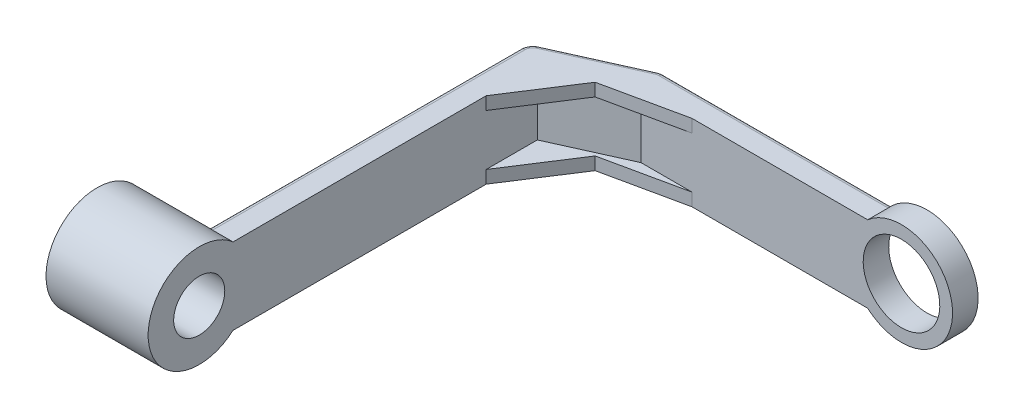
ISO-10303-21;
HEADER;
FILE_DESCRIPTION(('STEP AP214'),'2;1');
FILE_NAME('part.step','',(''),(''),'','','');
FILE_SCHEMA(('AUTOMOTIVE_DESIGN { 1 0 10303 214 1 1 1 1 }'));
ENDSEC;
DATA;
#1=APPLICATION_CONTEXT('core data for automotive mechanical design processes');
#2=APPLICATION_PROTOCOL_DEFINITION('international standard','automotive_design',2000,#1);
#3=PRODUCT_CONTEXT('',#1,'mechanical');
#4=PRODUCT('Part','Part','',(#3));
#5=PRODUCT_RELATED_PRODUCT_CATEGORY('part','',(#4));
#6=PRODUCT_DEFINITION_FORMATION('','',#4);
#7=PRODUCT_DEFINITION_CONTEXT('part definition',#1,'design');
#8=PRODUCT_DEFINITION('design','',#6,#7);
#9=PRODUCT_DEFINITION_SHAPE('','',#8);
#10=(LENGTH_UNIT() NAMED_UNIT(*) SI_UNIT(.MILLI.,.METRE.));
#11=(NAMED_UNIT(*) PLANE_ANGLE_UNIT() SI_UNIT($,.RADIAN.));
#12=(NAMED_UNIT(*) SI_UNIT($,.STERADIAN.) SOLID_ANGLE_UNIT());
#13=UNCERTAINTY_MEASURE_WITH_UNIT(LENGTH_MEASURE(1.E-05),#10,'distance_accuracy_value','');
#14=(GEOMETRIC_REPRESENTATION_CONTEXT(3) GLOBAL_UNCERTAINTY_ASSIGNED_CONTEXT((#13)) GLOBAL_UNIT_ASSIGNED_CONTEXT((#10,
#11,#12)) REPRESENTATION_CONTEXT('',''));
#15=CARTESIAN_POINT('',(0.,0.,0.));
#16=DIRECTION('',(0.,0.,1.));
#17=DIRECTION('',(1.,0.,0.));
#18=AXIS2_PLACEMENT_3D('',#15,#16,#17);
#19=CARTESIAN_POINT('',(28.0050724767935,-15.,-145.));
#20=DIRECTION('',(0.410514823388502,0.,0.911853924583487));
#21=DIRECTION('',(0.911853924583487,0.,-0.410514823388502));
#22=AXIS2_PLACEMENT_3D('',#19,#20,#21);
#23=PLANE('',#22);
#24=DIRECTION('',(0.911853924583487,0.,-0.410514823388502));
#25=VECTOR('',#24,1.);
#26=CARTESIAN_POINT('',(9.76799398512372,10.,-136.78970353223));
#27=LINE('',#26,#25);
#28=CARTESIAN_POINT('',(0.,10.,-132.392172066327));
#29=VERTEX_POINT('',#28);
#30=CARTESIAN_POINT('',(28.0050724767935,10.,-145.));
#31=VERTEX_POINT('',#30);
#32=EDGE_CURVE('E211',#29,#31,#27,.T.);
#33=ORIENTED_EDGE('',*,*,#32,.F.);
#34=DIRECTION('',(0.,1.,0.));
#35=VECTOR('',#34,1.);
#36=CARTESIAN_POINT('',(0.,-15.,-132.392172066327));
#37=LINE('',#36,#35);
#38=CARTESIAN_POINT('',(0.,-10.,-132.392172066327));
#39=VERTEX_POINT('',#38);
#40=EDGE_CURVE('E203',#39,#29,#37,.T.);
#41=ORIENTED_EDGE('',*,*,#40,.F.);
#42=DIRECTION('',(0.911853924583487,0.,-0.410514823388502));
#43=VECTOR('',#42,1.);
#44=CARTESIAN_POINT('',(9.76799398512372,-10.,-136.78970353223));
#45=LINE('',#44,#43);
#46=CARTESIAN_POINT('',(28.0050724767935,-10.,-145.));
#47=VERTEX_POINT('',#46);
#48=EDGE_CURVE('E187',#39,#47,#45,.T.);
#49=ORIENTED_EDGE('',*,*,#48,.T.);
#50=DIRECTION('',(0.,-1.,0.));
#51=VECTOR('',#50,1.);
#52=CARTESIAN_POINT('',(28.0050724767935,-15.,-145.));
#53=LINE('',#52,#51);
#54=EDGE_CURVE('E229',#31,#47,#53,.T.);
#55=ORIENTED_EDGE('',*,*,#54,.F.);
#56=EDGE_LOOP('',(#33,#41,#49,#55));
#57=FACE_BOUND('',#56,.T.);
#58=ADVANCED_FACE('F38',(#57),#23,.T.);
#59=CARTESIAN_POINT('',(0.,-15.,-15.));
#60=DIRECTION('',(1.,0.,0.));
#61=DIRECTION('',(0.,0.,-1.));
#62=AXIS2_PLACEMENT_3D('',#59,#60,#61);
#63=PLANE('',#62);
#64=CARTESIAN_POINT('',(0.,0.,0.));
#65=DIRECTION('',(1.,0.,0.));
#66=DIRECTION('',(0.,0.,-1.));
#67=AXIS2_PLACEMENT_3D('',#64,#65,#66);
#68=CIRCLE('',#67,10.);
#69=CARTESIAN_POINT('',(0.,0.,-10.));
#70=VERTEX_POINT('',#69);
#71=EDGE_CURVE('E452',#70,#70,#68,.T.);
#72=ORIENTED_EDGE('',*,*,#71,.F.);
#73=EDGE_LOOP('',(#72));
#74=FACE_BOUND('',#73,.T.);
#75=DIRECTION('',(0.,0.,-1.));
#76=VECTOR('',#75,1.);
#77=CARTESIAN_POINT('',(0.,10.,-112.392172066327));
#78=LINE('',#77,#76);
#79=CARTESIAN_POINT('',(0.,10.,-112.392172066327));
#80=VERTEX_POINT('',#79);
#81=EDGE_CURVE('E469',#80,#29,#78,.T.);
#82=ORIENTED_EDGE('',*,*,#81,.F.);
#83=DIRECTION('',(0.,1.,0.));
#84=VECTOR('',#83,1.);
#85=CARTESIAN_POINT('',(0.,10.,-112.392172066327));
#86=LINE('',#85,#84);
#87=CARTESIAN_POINT('',(0.,15.,-112.392172066327));
#88=VERTEX_POINT('',#87);
#89=EDGE_CURVE('E467',#80,#88,#86,.T.);
#90=ORIENTED_EDGE('',*,*,#89,.T.);
#91=DIRECTION('',(0.,0.,-1.));
#92=VECTOR('',#91,1.);
#93=CARTESIAN_POINT('',(0.,15.,-15.));
#94=LINE('',#93,#92);
#95=CARTESIAN_POINT('',(0.,15.,-13.228756555323));
#96=VERTEX_POINT('',#95);
#97=EDGE_CURVE('E218',#96,#88,#94,.T.);
#98=ORIENTED_EDGE('',*,*,#97,.F.);
#99=CARTESIAN_POINT('',(0.,0.,0.));
#100=DIRECTION('',(1.,0.,0.));
#101=DIRECTION('',(0.,0.,-1.));
#102=AXIS2_PLACEMENT_3D('',#99,#100,#101);
#103=CIRCLE('',#102,20.);
#104=CARTESIAN_POINT('',(0.,-15.,-13.228756555323));
#105=VERTEX_POINT('',#104);
#106=EDGE_CURVE('E437',#96,#105,#103,.T.);
#107=ORIENTED_EDGE('',*,*,#106,.T.);
#108=DIRECTION('',(0.,0.,-1.));
#109=VECTOR('',#108,1.);
#110=CARTESIAN_POINT('',(0.,-15.,-15.));
#111=LINE('',#110,#109);
#112=CARTESIAN_POINT('',(0.,-15.,-112.392172066327));
#113=VERTEX_POINT('',#112);
#114=EDGE_CURVE('E213',#105,#113,#111,.T.);
#115=ORIENTED_EDGE('',*,*,#114,.T.);
#116=DIRECTION('',(0.,-1.,0.));
#117=VECTOR('',#116,1.);
#118=CARTESIAN_POINT('',(0.,-10.,-112.392172066327));
#119=LINE('',#118,#117);
#120=CARTESIAN_POINT('',(0.,-10.,-112.392172066327));
#121=VERTEX_POINT('',#120);
#122=EDGE_CURVE('E207',#121,#113,#119,.T.);
#123=ORIENTED_EDGE('',*,*,#122,.F.);
#124=DIRECTION('',(0.,0.,-1.));
#125=VECTOR('',#124,1.);
#126=CARTESIAN_POINT('',(0.,-10.,-112.392172066327));
#127=LINE('',#126,#125);
#128=EDGE_CURVE('E191',#121,#39,#127,.T.);
#129=ORIENTED_EDGE('',*,*,#128,.T.);
#130=ORIENTED_EDGE('',*,*,#40,.T.);
#131=EDGE_LOOP('',(#82,#90,#98,#107,#115,#123,#129,#130));
#132=FACE_BOUND('',#131,.T.);
#133=ADVANCED_FACE('F202',(#74,#132),#63,.T.);
#134=CARTESIAN_POINT('',(48.0050724767935,10.,-145.));
#135=DIRECTION('',(-0.209935794252092,0.,-0.977715174420313));
#136=DIRECTION('',(-0.977715174420313,0.,0.209935794252092));
#137=AXIS2_PLACEMENT_3D('',#134,#135,#136);
#138=PLANE('',#137);
#139=DIRECTION('',(0.,1.,0.));
#140=VECTOR('',#139,1.);
#141=CARTESIAN_POINT('',(16.7400359856065,10.,-138.286746038293));
#142=LINE('',#141,#140);
#143=CARTESIAN_POINT('',(16.7400359856065,10.,-138.286746038293));
#144=VERTEX_POINT('',#143);
#145=CARTESIAN_POINT('',(16.7400359856064,15.,-138.286746038293));
#146=VERTEX_POINT('',#145);
#147=EDGE_CURVE('E468',#144,#146,#142,.T.);
#148=ORIENTED_EDGE('',*,*,#147,.F.);
#149=DIRECTION('',(-0.977715174420313,0.,0.209935794252092));
#150=VECTOR('',#149,1.);
#151=CARTESIAN_POINT('',(48.0050724767935,10.,-145.));
#152=LINE('',#151,#150);
#153=CARTESIAN_POINT('',(48.0050724767935,10.,-145.));
#154=VERTEX_POINT('',#153);
#155=EDGE_CURVE('E483',#154,#144,#152,.T.);
#156=ORIENTED_EDGE('',*,*,#155,.F.);
#157=DIRECTION('',(0.,1.,0.));
#158=VECTOR('',#157,1.);
#159=CARTESIAN_POINT('',(48.0050724767935,10.,-145.));
#160=LINE('',#159,#158);
#161=CARTESIAN_POINT('',(48.0050724767935,15.,-145.));
#162=VERTEX_POINT('',#161);
#163=EDGE_CURVE('E489',#154,#162,#160,.T.);
#164=ORIENTED_EDGE('',*,*,#163,.T.);
#165=DIRECTION('',(-0.977715174420313,0.,0.209935794252092));
#166=VECTOR('',#165,1.);
#167=CARTESIAN_POINT('',(48.0050724767935,15.,-145.));
#168=LINE('',#167,#166);
#169=EDGE_CURVE('E481',#162,#146,#168,.T.);
#170=ORIENTED_EDGE('',*,*,#169,.T.);
#171=EDGE_LOOP('',(#148,#156,#164,#170));
#172=FACE_BOUND('',#171,.T.);
#173=ADVANCED_FACE('F374',(#172),#138,.F.);
#174=CARTESIAN_POINT('',(130.,0.,-145.));
#175=DIRECTION('',(0.,0.,1.));
#176=DIRECTION('',(0.,1.,0.));
#177=AXIS2_PLACEMENT_3D('',#174,#175,#176);
#178=PLANE('',#177);
#179=CARTESIAN_POINT('',(130.,0.,-145.));
#180=DIRECTION('',(0.,0.,1.));
#181=DIRECTION('',(0.,1.,0.));
#182=AXIS2_PLACEMENT_3D('',#179,#180,#181);
#183=CIRCLE('',#182,15.);
#184=CARTESIAN_POINT('',(130.,15.,-145.));
#185=VERTEX_POINT('',#184);
#186=EDGE_CURVE('E216',#185,#185,#183,.T.);
#187=ORIENTED_EDGE('',*,*,#186,.F.);
#188=EDGE_LOOP('',(#187));
#189=FACE_BOUND('',#188,.T.);
#190=DIRECTION('',(-1.,0.,0.));
#191=VECTOR('',#190,1.);
#192=CARTESIAN_POINT('',(28.0050724767935,15.,-145.));
#193=LINE('',#192,#191);
#194=CARTESIAN_POINT('',(116.771243444677,15.,-145.));
#195=VERTEX_POINT('',#194);
#196=EDGE_CURVE('E227',#195,#162,#193,.T.);
#197=ORIENTED_EDGE('',*,*,#196,.T.);
#198=ORIENTED_EDGE('',*,*,#163,.F.);
#199=DIRECTION('',(1.,0.,0.));
#200=VECTOR('',#199,1.);
#201=CARTESIAN_POINT('',(28.0050724767935,10.,-145.));
#202=LINE('',#201,#200);
#203=EDGE_CURVE('E486',#31,#154,#202,.T.);
#204=ORIENTED_EDGE('',*,*,#203,.F.);
#205=ORIENTED_EDGE('',*,*,#54,.T.);
#206=DIRECTION('',(1.,0.,0.));
#207=VECTOR('',#206,1.);
#208=CARTESIAN_POINT('',(28.0050724767935,-10.,-145.));
#209=LINE('',#208,#207);
#210=CARTESIAN_POINT('',(48.0050724767935,-10.,-145.));
#211=VERTEX_POINT('',#210);
#212=EDGE_CURVE('E194',#47,#211,#209,.T.);
#213=ORIENTED_EDGE('',*,*,#212,.T.);
#214=DIRECTION('',(0.,-1.,0.));
#215=VECTOR('',#214,1.);
#216=CARTESIAN_POINT('',(48.0050724767935,-10.,-145.));
#217=LINE('',#216,#215);
#218=CARTESIAN_POINT('',(48.0050724767935,-15.,-145.));
#219=VERTEX_POINT('',#218);
#220=EDGE_CURVE('E428',#211,#219,#217,.T.);
#221=ORIENTED_EDGE('',*,*,#220,.T.);
#222=DIRECTION('',(1.,0.,0.));
#223=VECTOR('',#222,1.);
#224=CARTESIAN_POINT('',(28.0050724767935,-15.,-145.));
#225=LINE('',#224,#223);
#226=CARTESIAN_POINT('',(116.771243444677,-15.,-145.));
#227=VERTEX_POINT('',#226);
#228=EDGE_CURVE('E231',#219,#227,#225,.T.);
#229=ORIENTED_EDGE('',*,*,#228,.T.);
#230=CARTESIAN_POINT('',(130.,0.,-145.));
#231=DIRECTION('',(0.,0.,1.));
#232=DIRECTION('',(0.,1.,0.));
#233=AXIS2_PLACEMENT_3D('',#230,#231,#232);
#234=CIRCLE('',#233,20.);
#235=EDGE_CURVE('E224',#227,#195,#234,.T.);
#236=ORIENTED_EDGE('',*,*,#235,.T.);
#237=EDGE_LOOP('',(#197,#198,#204,#205,#213,#221,#229,#236));
#238=FACE_BOUND('',#237,.T.);
#239=ADVANCED_FACE('F390',(#189,#238),#178,.T.);
#240=CARTESIAN_POINT('',(28.0050724767935,15.,-145.));
#241=DIRECTION('',(0.,-1.,0.));
#242=DIRECTION('',(1.,0.,0.));
#243=AXIS2_PLACEMENT_3D('',#240,#241,#242);
#244=PLANE('',#243);
#245=CARTESIAN_POINT('',(-5.00000000000003,15.,-135.624516418416));
#246=DIRECTION('',(0.,-1.,0.));
#247=DIRECTION('',(1.,0.,0.));
#248=AXIS2_PLACEMENT_3D('',#245,#246,#247);
#249=CIRCLE('',#248,3.);
#250=CARTESIAN_POINT('',(-6.23154447016555,15.,-138.360078192166));
#251=VERTEX_POINT('',#250);
#252=CARTESIAN_POINT('',(-8.00000000000004,15.,-135.624516418416));
#253=VERTEX_POINT('',#252);
#254=EDGE_CURVE('E258',#251,#253,#249,.F.);
#255=ORIENTED_EDGE('',*,*,#254,.T.);
#256=DIRECTION('',(0.,0.,1.));
#257=VECTOR('',#256,1.);
#258=CARTESIAN_POINT('',(-8.00000000000001,15.,-13.228756555323));
#259=LINE('',#258,#257);
#260=CARTESIAN_POINT('',(-8.00000000000001,15.,-13.228756555323));
#261=VERTEX_POINT('',#260);
#262=EDGE_CURVE('E260',#253,#261,#259,.T.);
#263=ORIENTED_EDGE('',*,*,#262,.T.);
#264=DIRECTION('',(-1.,0.,0.));
#265=VECTOR('',#264,1.);
#266=CARTESIAN_POINT('',(0.,15.,-13.228756555323));
#267=LINE('',#266,#265);
#268=EDGE_CURVE('E442',#96,#261,#267,.T.);
#269=ORIENTED_EDGE('',*,*,#268,.F.);
#270=ORIENTED_EDGE('',*,*,#97,.T.);
#271=DIRECTION('',(-0.542902006172154,0.,0.839796053631029));
#272=VECTOR('',#271,1.);
#273=CARTESIAN_POINT('',(18.2370784916697,15.,-140.602468534097));
#274=LINE('',#273,#272);
#275=EDGE_CURVE('E462',#146,#88,#274,.T.);
#276=ORIENTED_EDGE('',*,*,#275,.F.);
#277=ORIENTED_EDGE('',*,*,#169,.F.);
#278=ORIENTED_EDGE('',*,*,#196,.F.);
#279=DIRECTION('',(0.,0.,-1.));
#280=VECTOR('',#279,1.);
#281=CARTESIAN_POINT('',(116.771243444677,15.,-145.));
#282=LINE('',#281,#280);
#283=CARTESIAN_POINT('',(116.771243444677,15.,-153.));
#284=VERTEX_POINT('',#283);
#285=EDGE_CURVE('E237',#195,#284,#282,.T.);
#286=ORIENTED_EDGE('',*,*,#285,.T.);
#287=DIRECTION('',(-1.,0.,0.));
#288=VECTOR('',#287,1.);
#289=CARTESIAN_POINT('',(28.0050724767935,15.,-153.));
#290=LINE('',#289,#288);
#291=CARTESIAN_POINT('',(26.9314684265312,15.,-153.));
#292=VERTEX_POINT('',#291);
#293=EDGE_CURVE('E252',#284,#292,#290,.T.);
#294=ORIENTED_EDGE('',*,*,#293,.T.);
#295=CARTESIAN_POINT('',(26.9314684265312,15.,-150.));
#296=DIRECTION('',(0.,-1.,0.));
#297=DIRECTION('',(1.,0.,0.));
#298=AXIS2_PLACEMENT_3D('',#295,#296,#297);
#299=CIRCLE('',#298,3.);
#300=CARTESIAN_POINT('',(25.6999239563657,15.,-152.735561773751));
#301=VERTEX_POINT('',#300);
#302=EDGE_CURVE('E254',#292,#301,#299,.F.);
#303=ORIENTED_EDGE('',*,*,#302,.T.);
#304=DIRECTION('',(-0.911853924583486,0.,0.410514823388503));
#305=VECTOR('',#304,1.);
#306=CARTESIAN_POINT('',(-6.23154447016555,15.,-138.360078192166));
#307=LINE('',#306,#305);
#308=EDGE_CURVE('E256',#301,#251,#307,.T.);
#309=ORIENTED_EDGE('',*,*,#308,.T.);
#310=EDGE_LOOP('',(#255,#263,#269,#270,#276,#277,#278,#286,#294,#303,#309));
#311=FACE_BOUND('',#310,.T.);
#312=ADVANCED_FACE('F353',(#311),#244,.F.);
#313=CARTESIAN_POINT('',(28.0050724767935,-15.,-145.));
#314=DIRECTION('',(0.,1.,0.));
#315=DIRECTION('',(-1.,0.,0.));
#316=AXIS2_PLACEMENT_3D('',#313,#314,#315);
#317=PLANE('',#316);
#318=CARTESIAN_POINT('',(26.9314684265312,-15.,-150.));
#319=DIRECTION('',(0.,1.,0.));
#320=DIRECTION('',(-1.,0.,0.));
#321=AXIS2_PLACEMENT_3D('',#318,#319,#320);
#322=CIRCLE('',#321,3.);
#323=CARTESIAN_POINT('',(25.6999239563657,-15.,-152.735561773751));
#324=VERTEX_POINT('',#323);
#325=CARTESIAN_POINT('',(26.9314684265312,-15.,-153.));
#326=VERTEX_POINT('',#325);
#327=EDGE_CURVE('E285',#324,#326,#322,.F.);
#328=ORIENTED_EDGE('',*,*,#327,.T.);
#329=DIRECTION('',(1.,0.,0.));
#330=VECTOR('',#329,1.);
#331=CARTESIAN_POINT('',(28.0050724767935,-15.,-153.));
#332=LINE('',#331,#330);
#333=CARTESIAN_POINT('',(116.771243444677,-15.,-153.));
#334=VERTEX_POINT('',#333);
#335=EDGE_CURVE('E287',#326,#334,#332,.T.);
#336=ORIENTED_EDGE('',*,*,#335,.T.);
#337=DIRECTION('',(0.,0.,-1.));
#338=VECTOR('',#337,1.);
#339=CARTESIAN_POINT('',(116.771243444677,-15.,-145.));
#340=LINE('',#339,#338);
#341=EDGE_CURVE('E233',#227,#334,#340,.T.);
#342=ORIENTED_EDGE('',*,*,#341,.F.);
#343=ORIENTED_EDGE('',*,*,#228,.F.);
#344=DIRECTION('',(-0.977715174420313,0.,0.209935794252092));
#345=VECTOR('',#344,1.);
#346=CARTESIAN_POINT('',(48.0050724767935,-15.,-145.));
#347=LINE('',#346,#345);
#348=CARTESIAN_POINT('',(16.7400359856064,-15.,-138.286746038293));
#349=VERTEX_POINT('',#348);
#350=EDGE_CURVE('E198',#219,#349,#347,.T.);
#351=ORIENTED_EDGE('',*,*,#350,.T.);
#352=DIRECTION('',(-0.542902006172154,0.,0.839796053631029));
#353=VECTOR('',#352,1.);
#354=CARTESIAN_POINT('',(18.2370784916697,-15.,-140.602468534097));
#355=LINE('',#354,#353);
#356=EDGE_CURVE('E209',#349,#113,#355,.T.);
#357=ORIENTED_EDGE('',*,*,#356,.T.);
#358=ORIENTED_EDGE('',*,*,#114,.F.);
#359=DIRECTION('',(-1.,0.,0.));
#360=VECTOR('',#359,1.);
#361=CARTESIAN_POINT('',(0.,-15.,-13.228756555323));
#362=LINE('',#361,#360);
#363=CARTESIAN_POINT('',(-8.00000000000001,-15.,-13.228756555323));
#364=VERTEX_POINT('',#363);
#365=EDGE_CURVE('E439',#105,#364,#362,.T.);
#366=ORIENTED_EDGE('',*,*,#365,.T.);
#367=DIRECTION('',(0.,0.,1.));
#368=VECTOR('',#367,1.);
#369=CARTESIAN_POINT('',(-8.00000000000004,-15.,-135.624516418416));
#370=LINE('',#369,#368);
#371=CARTESIAN_POINT('',(-8.00000000000004,-15.,-135.624516418416));
#372=VERTEX_POINT('',#371);
#373=EDGE_CURVE('E279',#364,#372,#370,.F.);
#374=ORIENTED_EDGE('',*,*,#373,.T.);
#375=CARTESIAN_POINT('',(-5.00000000000003,-15.,-135.624516418416));
#376=DIRECTION('',(0.,1.,0.));
#377=DIRECTION('',(-1.,0.,0.));
#378=AXIS2_PLACEMENT_3D('',#375,#376,#377);
#379=CIRCLE('',#378,3.);
#380=CARTESIAN_POINT('',(-6.23154447016555,-15.,-138.360078192166));
#381=VERTEX_POINT('',#380);
#382=EDGE_CURVE('E281',#372,#381,#379,.F.);
#383=ORIENTED_EDGE('',*,*,#382,.T.);
#384=DIRECTION('',(-0.911853924583486,0.,0.410514823388503));
#385=VECTOR('',#384,1.);
#386=CARTESIAN_POINT('',(25.6999239563657,-15.,-152.73556177375));
#387=LINE('',#386,#385);
#388=EDGE_CURVE('E283',#381,#324,#387,.F.);
#389=ORIENTED_EDGE('',*,*,#388,.T.);
#390=EDGE_LOOP('',(#328,#336,#342,#343,#351,#357,#358,#366,#374,#383,#389));
#391=FACE_BOUND('',#390,.T.);
#392=ADVANCED_FACE('F395',(#391),#317,.F.);
#393=CARTESIAN_POINT('',(130.,0.,-155.));
#394=DIRECTION('',(0.,0.,1.));
#395=DIRECTION('',(0.,1.,0.));
#396=AXIS2_PLACEMENT_3D('',#393,#394,#395);
#397=PLANE('',#396);
#398=CARTESIAN_POINT('',(130.,0.,-155.));
#399=DIRECTION('',(0.,0.,1.));
#400=DIRECTION('',(0.,1.,0.));
#401=AXIS2_PLACEMENT_3D('',#398,#399,#400);
#402=CIRCLE('',#401,20.);
#403=CARTESIAN_POINT('',(114.801315846429,-13.,-155.));
#404=VERTEX_POINT('',#403);
#405=CARTESIAN_POINT('',(114.801315846429,13.,-155.));
#406=VERTEX_POINT('',#405);
#407=EDGE_CURVE('E56',#404,#406,#402,.T.);
#408=ORIENTED_EDGE('',*,*,#407,.F.);
#409=DIRECTION('',(1.,0.,0.));
#410=VECTOR('',#409,1.);
#411=CARTESIAN_POINT('',(130.,-13.,-155.));
#412=LINE('',#411,#410);
#413=CARTESIAN_POINT('',(26.9314684265312,-13.,-155.));
#414=VERTEX_POINT('',#413);
#415=EDGE_CURVE('E292',#404,#414,#412,.F.);
#416=ORIENTED_EDGE('',*,*,#415,.T.);
#417=DIRECTION('',(0.,1.,0.));
#418=VECTOR('',#417,1.);
#419=CARTESIAN_POINT('',(26.9314684265312,15.,-155.));
#420=LINE('',#419,#418);
#421=CARTESIAN_POINT('',(26.9314684265312,13.,-155.));
#422=VERTEX_POINT('',#421);
#423=EDGE_CURVE('E240',#414,#422,#420,.T.);
#424=ORIENTED_EDGE('',*,*,#423,.T.);
#425=DIRECTION('',(-1.,0.,0.));
#426=VECTOR('',#425,1.);
#427=CARTESIAN_POINT('',(130.,13.,-155.));
#428=LINE('',#427,#426);
#429=EDGE_CURVE('E290',#422,#406,#428,.F.);
#430=ORIENTED_EDGE('',*,*,#429,.T.);
#431=EDGE_LOOP('',(#408,#416,#424,#430));
#432=FACE_BOUND('',#431,.T.);
#433=CARTESIAN_POINT('',(130.,0.,-155.));
#434=DIRECTION('',(0.,0.,1.));
#435=DIRECTION('',(0.,1.,0.));
#436=AXIS2_PLACEMENT_3D('',#433,#434,#435);
#437=CIRCLE('',#436,15.);
#438=CARTESIAN_POINT('',(130.,15.,-155.));
#439=VERTEX_POINT('',#438);
#440=EDGE_CURVE('E212',#439,#439,#437,.T.);
#441=ORIENTED_EDGE('',*,*,#440,.T.);
#442=EDGE_LOOP('',(#441));
#443=FACE_BOUND('',#442,.T.);
#444=ADVANCED_FACE('F352',(#432,#443),#397,.F.);
#445=CARTESIAN_POINT('',(130.,0.,-145.));
#446=DIRECTION('',(0.,0.,-1.));
#447=DIRECTION('',(0.,-1.,0.));
#448=AXIS2_PLACEMENT_3D('',#445,#446,#447);
#449=CYLINDRICAL_SURFACE('',#448,20.);
#450=ORIENTED_EDGE('',*,*,#407,.T.);
#451=CARTESIAN_POINT('',(114.801315846429,13.,-155.));
#452=CARTESIAN_POINT('',(114.856013777429,13.0639511802853,-154.999989044102));
#453=CARTESIAN_POINT('',(114.911085847796,13.1275172135985,-154.996933020918));
#454=CARTESIAN_POINT('',(115.021732096109,13.2536230802973,-154.984867083866));
#455=CARTESIAN_POINT('',(115.077306193183,13.3161630745556,-154.975858112684));
#456=CARTESIAN_POINT('',(115.245399596302,13.5029584290862,-154.939899014126));
#457=CARTESIAN_POINT('',(115.35833848463,13.6252775219159,-154.904020706975));
#458=CARTESIAN_POINT('',(115.536092663296,13.8132043504645,-154.828745149561));
#459=CARTESIAN_POINT('',(115.601531155942,13.8813818364313,-154.79691211563));
#460=CARTESIAN_POINT('',(115.731218863531,14.0146533395319,-154.725168322265));
#461=CARTESIAN_POINT('',(115.795467668989,14.0797463065819,-154.685254835986));
#462=CARTESIAN_POINT('',(115.92174194326,14.2060057242156,-154.597326115918));
#463=CARTESIAN_POINT('',(115.983774190629,14.2671846982615,-154.549338711182));
#464=CARTESIAN_POINT('',(116.104798658072,14.3850793377441,-154.444905014796));
#465=CARTESIAN_POINT('',(116.163793409247,14.441798740755,-154.388465924291));
#466=CARTESIAN_POINT('',(116.283797230511,14.555870330097,-154.259941711994));
#467=CARTESIAN_POINT('',(116.344303424162,14.6125943564167,-154.186815381737));
#468=CARTESIAN_POINT('',(116.457415695286,14.7174843549087,-154.029166531928));
#469=CARTESIAN_POINT('',(116.510032344623,14.7656617955193,-153.944659555948));
#470=CARTESIAN_POINT('',(116.594401980269,14.8422544170194,-153.782577304108));
#471=CARTESIAN_POINT('',(116.628222438726,14.8726957555815,-153.707051286597));
#472=CARTESIAN_POINT('',(116.686353594461,14.9247562773661,-153.549673914713));
#473=CARTESIAN_POINT('',(116.710689836775,14.9463991654533,-153.467840272533));
#474=CARTESIAN_POINT('',(116.742915422904,14.974980609069,-153.321643014989));
#475=CARTESIAN_POINT('',(116.753444180161,14.9842868310213,-153.258325590519));
#476=CARTESIAN_POINT('',(116.764073620136,14.993674447345,-153.162199074871));
#477=CARTESIAN_POINT('',(116.766756346972,14.9960418527025,-153.129876250686));
#478=CARTESIAN_POINT('',(116.770343458323,14.9992063257478,-153.065039102612));
#479=CARTESIAN_POINT('',(116.771246923778,15.0000025818742,-153.032524688453));
#480=CARTESIAN_POINT('',(116.771243444677,15.,-153.));
#481=B_SPLINE_CURVE_WITH_KNOTS('',3,(#451,#452,#453,#454,#455,#456,#457,#458,#459,#460,#461,
#462,#463,#464,#465,#466,#467,#468,#469,#470,#471,#472,#473,#474,#475,#476,#477,#478,#479,#480),
.UNSPECIFIED.,.F.,.F.,(4,2,2,2,2,2,2,2,2,2,2,2,2,2,4),(0.,0.252307129102847,0.504574313412681,
1.01346025208701,1.31231193217793,1.61126463202238,1.9092072589003,2.2068974571458,
2.53762029265011,2.86789592653549,3.13144084346645,3.3942709330152,3.58817804949007,
3.6856599322084,3.78319215505016),.UNSPECIFIED.);
#482=EDGE_CURVE('E48',#406,#284,#481,.T.);
#483=ORIENTED_EDGE('',*,*,#482,.T.);
#484=ORIENTED_EDGE('',*,*,#285,.F.);
#485=ORIENTED_EDGE('',*,*,#235,.F.);
#486=ORIENTED_EDGE('',*,*,#341,.T.);
#487=CARTESIAN_POINT('',(116.771243444677,-15.,-153.));
#488=CARTESIAN_POINT('',(116.771259618162,-15.0000123634797,-153.043819736115));
#489=CARTESIAN_POINT('',(116.769611066522,-14.9985603445735,-153.087627717654));
#490=CARTESIAN_POINT('',(116.763109481127,-14.9928237249708,-153.174771293646));
#491=CARTESIAN_POINT('',(116.7582599903,-14.9885422560177,-153.218107356592));
#492=CARTESIAN_POINT('',(116.745548538152,-14.977302260874,-153.303503041028));
#493=CARTESIAN_POINT('',(116.737718965657,-14.9703725141488,-153.345571313388));
#494=CARTESIAN_POINT('',(116.719258476853,-14.9539980476626,-153.428583512717));
#495=CARTESIAN_POINT('',(116.708626951026,-14.9445527806864,-153.469527192906));
#496=CARTESIAN_POINT('',(116.672995574851,-14.9128119559541,-153.589917008631));
#497=CARTESIAN_POINT('',(116.644188797343,-14.887049951184,-153.667365973917));
#498=CARTESIAN_POINT('',(116.578488556553,-14.8278451677054,-153.815723524202));
#499=CARTESIAN_POINT('',(116.541571485512,-14.7943799523142,-153.886612138669));
#500=CARTESIAN_POINT('',(116.441444152823,-14.7027938470325,-154.055363136449));
#501=CARTESIAN_POINT('',(116.374362501564,-14.6407495682157,-154.148801845172));
#502=CARTESIAN_POINT('',(116.231354016067,-14.5063469049076,-154.320162302678));
#503=CARTESIAN_POINT('',(116.155407761611,-14.4339657943812,-154.398048929814));
#504=CARTESIAN_POINT('',(115.967517074355,-14.2517522407868,-154.566498900147));
#505=CARTESIAN_POINT('',(115.853026789888,-14.138275586986,-154.650280062784));
#506=CARTESIAN_POINT('',(115.619244069979,-13.9004239239717,-154.791188273654));
#507=CARTESIAN_POINT('',(115.499948210809,-13.7760410676582,-154.84829594005));
#508=CARTESIAN_POINT('',(115.283086773164,-13.543733108489,-154.927796475064));
#509=CARTESIAN_POINT('',(115.185702923709,-13.4371763457761,-154.954725716567));
#510=CARTESIAN_POINT('',(115.040542983875,-13.2747846282523,-154.981789608291));
#511=CARTESIAN_POINT('',(114.992396502404,-13.2203302259727,-154.988588908299));
#512=CARTESIAN_POINT('',(114.89650802234,-13.1106767673783,-154.997691860645));
#513=CARTESIAN_POINT('',(114.848766104156,-13.0554775684313,-154.999994639211));
#514=CARTESIAN_POINT('',(114.801315846429,-13.,-155.));
#515=B_SPLINE_CURVE_WITH_KNOTS('',3,(#487,#488,#489,#490,#491,#492,#493,#494,#495,#496,#497,
#498,#499,#500,#501,#502,#503,#504,#505,#506,#507,#508,#509,#510,#511,#512,#513,#514),
.UNSPECIFIED.,.F.,.F.,(4,2,2,2,2,2,2,2,2,2,2,2,2,4),(0.,0.131385182835828,0.262625186545353,
0.392477764158907,0.522358612439319,0.780777853389152,1.03995952011816,1.42983637685598,
1.82058398429276,2.36274009603306,2.90528954565418,3.34466498202114,3.56355074538893,
3.78247903875162),.UNSPECIFIED.);
#516=EDGE_CURVE('E301',#334,#404,#515,.T.);
#517=ORIENTED_EDGE('',*,*,#516,.T.);
#518=EDGE_LOOP('',(#450,#483,#484,#485,#486,#517));
#519=FACE_BOUND('',#518,.T.);
#520=ADVANCED_FACE('F347',(#519),#449,.T.);
#521=CARTESIAN_POINT('',(130.,0.,-145.));
#522=DIRECTION('',(0.,0.,-1.));
#523=DIRECTION('',(0.,-1.,0.));
#524=AXIS2_PLACEMENT_3D('',#521,#522,#523);
#525=CYLINDRICAL_SURFACE('',#524,15.);
#526=ORIENTED_EDGE('',*,*,#186,.T.);
#527=EDGE_LOOP('',(#526));
#528=FACE_BOUND('',#527,.T.);
#529=ORIENTED_EDGE('',*,*,#440,.F.);
#530=EDGE_LOOP('',(#529));
#531=FACE_BOUND('',#530,.T.);
#532=ADVANCED_FACE('F351',(#528,#531),#525,.F.);
#533=CARTESIAN_POINT('',(-10.,-15.,-138.856860770505));
#534=DIRECTION('',(-1.,0.,0.));
#535=DIRECTION('',(0.,0.,1.));
#536=AXIS2_PLACEMENT_3D('',#533,#534,#535);
#537=PLANE('',#536);
#538=CARTESIAN_POINT('',(-10.,0.,0.));
#539=DIRECTION('',(-1.,0.,0.));
#540=DIRECTION('',(0.,0.,1.));
#541=AXIS2_PLACEMENT_3D('',#538,#539,#540);
#542=CIRCLE('',#541,20.);
#543=CARTESIAN_POINT('',(-10.,13.,-15.1986841535707));
#544=VERTEX_POINT('',#543);
#545=CARTESIAN_POINT('',(-10.,-13.,-15.1986841535706));
#546=VERTEX_POINT('',#545);
#547=EDGE_CURVE('E448',#544,#546,#542,.T.);
#548=ORIENTED_EDGE('',*,*,#547,.F.);
#549=DIRECTION('',(0.,0.,1.));
#550=VECTOR('',#549,1.);
#551=CARTESIAN_POINT('',(-10.,13.,-135.624516418416));
#552=LINE('',#551,#550);
#553=CARTESIAN_POINT('',(-10.,13.,-135.624516418416));
#554=VERTEX_POINT('',#553);
#555=EDGE_CURVE('E265',#544,#554,#552,.F.);
#556=ORIENTED_EDGE('',*,*,#555,.T.);
#557=DIRECTION('',(0.,1.,0.));
#558=VECTOR('',#557,1.);
#559=CARTESIAN_POINT('',(-10.,-15.,-135.624516418416));
#560=LINE('',#559,#558);
#561=CARTESIAN_POINT('',(-10.,-13.,-135.624516418416));
#562=VERTEX_POINT('',#561);
#563=EDGE_CURVE('E249',#554,#562,#560,.F.);
#564=ORIENTED_EDGE('',*,*,#563,.T.);
#565=DIRECTION('',(0.,0.,1.));
#566=VECTOR('',#565,1.);
#567=CARTESIAN_POINT('',(-10.,-13.,-13.228756555323));
#568=LINE('',#567,#566);
#569=EDGE_CURVE('E263',#562,#546,#568,.T.);
#570=ORIENTED_EDGE('',*,*,#569,.T.);
#571=EDGE_LOOP('',(#548,#556,#564,#570));
#572=FACE_BOUND('',#571,.T.);
#573=ADVANCED_FACE('F379',(#572),#537,.T.);
#574=CARTESIAN_POINT('',(-10.,-15.,-138.856860770505));
#575=DIRECTION('',(-0.410514823388503,0.,-0.911853924583486));
#576=DIRECTION('',(-0.911853924583486,0.,0.410514823388503));
#577=AXIS2_PLACEMENT_3D('',#574,#575,#576);
#578=PLANE('',#577);
#579=DIRECTION('',(0.,1.,0.));
#580=VECTOR('',#579,1.);
#581=CARTESIAN_POINT('',(-7.05257411694254,-15.,-140.183786041333));
#582=LINE('',#581,#580);
#583=CARTESIAN_POINT('',(-7.05257411694254,-13.,-140.183786041333));
#584=VERTEX_POINT('',#583);
#585=CARTESIAN_POINT('',(-7.05257411694254,13.,-140.183786041333));
#586=VERTEX_POINT('',#585);
#587=EDGE_CURVE('E246',#584,#586,#582,.T.);
#588=ORIENTED_EDGE('',*,*,#587,.T.);
#589=DIRECTION('',(-0.911853924583486,0.,0.410514823388503));
#590=VECTOR('',#589,1.);
#591=CARTESIAN_POINT('',(24.8788943095887,13.,-154.559269622917));
#592=LINE('',#591,#590);
#593=CARTESIAN_POINT('',(24.8788943095887,13.,-154.559269622917));
#594=VERTEX_POINT('',#593);
#595=EDGE_CURVE('E273',#586,#594,#592,.F.);
#596=ORIENTED_EDGE('',*,*,#595,.T.);
#597=DIRECTION('',(0.,1.,0.));
#598=VECTOR('',#597,1.);
#599=CARTESIAN_POINT('',(24.8788943095887,-15.,-154.559269622917));
#600=LINE('',#599,#598);
#601=CARTESIAN_POINT('',(24.8788943095887,-13.,-154.559269622917));
#602=VERTEX_POINT('',#601);
#603=EDGE_CURVE('E243',#594,#602,#600,.F.);
#604=ORIENTED_EDGE('',*,*,#603,.T.);
#605=DIRECTION('',(-0.911853924583486,0.,0.410514823388503));
#606=VECTOR('',#605,1.);
#607=CARTESIAN_POINT('',(-7.05257411694254,-13.,-140.183786041333));
#608=LINE('',#607,#606);
#609=EDGE_CURVE('E271',#602,#584,#608,.T.);
#610=ORIENTED_EDGE('',*,*,#609,.T.);
#611=EDGE_LOOP('',(#588,#596,#604,#610));
#612=FACE_BOUND('',#611,.T.);
#613=ADVANCED_FACE('F382',(#612),#578,.T.);
#614=CARTESIAN_POINT('',(-10.,0.,0.));
#615=DIRECTION('',(1.,0.,0.));
#616=DIRECTION('',(0.,0.,-1.));
#617=AXIS2_PLACEMENT_3D('',#614,#615,#616);
#618=CYLINDRICAL_SURFACE('',#617,10.);
#619=ORIENTED_EDGE('',*,*,#71,.T.);
#620=EDGE_LOOP('',(#619));
#621=FACE_BOUND('',#620,.T.);
#622=CARTESIAN_POINT('',(-30.,0.,0.));
#623=DIRECTION('',(1.,0.,0.));
#624=DIRECTION('',(0.,0.,-1.));
#625=AXIS2_PLACEMENT_3D('',#622,#623,#624);
#626=CIRCLE('',#625,10.);
#627=CARTESIAN_POINT('',(-30.,0.,-10.));
#628=VERTEX_POINT('',#627);
#629=EDGE_CURVE('E445',#628,#628,#626,.T.);
#630=ORIENTED_EDGE('',*,*,#629,.F.);
#631=EDGE_LOOP('',(#630));
#632=FACE_BOUND('',#631,.T.);
#633=ADVANCED_FACE('F377',(#621,#632),#618,.F.);
#634=CARTESIAN_POINT('',(-40.,0.,0.));
#635=DIRECTION('',(-1.,0.,0.));
#636=DIRECTION('',(0.,0.,1.));
#637=AXIS2_PLACEMENT_3D('',#634,#635,#636);
#638=PLANE('',#637);
#639=CARTESIAN_POINT('',(-40.,0.,0.));
#640=DIRECTION('',(-1.,0.,0.));
#641=DIRECTION('',(0.,0.,1.));
#642=AXIS2_PLACEMENT_3D('',#639,#640,#641);
#643=CIRCLE('',#642,20.);
#644=CARTESIAN_POINT('',(-40.,0.,20.));
#645=VERTEX_POINT('',#644);
#646=EDGE_CURVE('E449',#645,#645,#643,.T.);
#647=ORIENTED_EDGE('',*,*,#646,.T.);
#648=EDGE_LOOP('',(#647));
#649=FACE_BOUND('',#648,.T.);
#650=ADVANCED_FACE('F564',(#649),#638,.T.);
#651=CARTESIAN_POINT('',(-40.,0.,0.));
#652=DIRECTION('',(1.,0.,0.));
#653=DIRECTION('',(0.,0.,-1.));
#654=AXIS2_PLACEMENT_3D('',#651,#652,#653);
#655=CYLINDRICAL_SURFACE('',#654,20.);
#656=ORIENTED_EDGE('',*,*,#646,.F.);
#657=EDGE_LOOP('',(#656));
#658=FACE_BOUND('',#657,.T.);
#659=ORIENTED_EDGE('',*,*,#268,.T.);
#660=CARTESIAN_POINT('',(-8.00000000000001,15.,-13.228756555323));
#661=CARTESIAN_POINT('',(-8.04381973611463,15.0000123634797,-13.2287403818383));
#662=CARTESIAN_POINT('',(-8.08762771765347,14.9985603445735,-13.2303889334777));
#663=CARTESIAN_POINT('',(-8.1747712936455,14.9928237249708,-13.236890518873));
#664=CARTESIAN_POINT('',(-8.2181073565915,14.9885422560176,-13.2417400097001));
#665=CARTESIAN_POINT('',(-8.30350304102751,14.977302260874,-13.2544514618482));
#666=CARTESIAN_POINT('',(-8.34557131338826,14.9703725141488,-13.2622810343433));
#667=CARTESIAN_POINT('',(-8.4285835127171,14.9539980476626,-13.2807415231467));
#668=CARTESIAN_POINT('',(-8.46952719290594,14.9445527806863,-13.2913730489744));
#669=CARTESIAN_POINT('',(-8.58991700863057,14.9128119559541,-13.3270044251487));
#670=CARTESIAN_POINT('',(-8.667365973917,14.887049951184,-13.3558112026573));
#671=CARTESIAN_POINT('',(-8.81572352420201,14.8278451677054,-13.4215114434474));
#672=CARTESIAN_POINT('',(-8.88661213866872,14.7943799523142,-13.4584285144881));
#673=CARTESIAN_POINT('',(-9.05536313644851,14.7027938470325,-13.5585558471766));
#674=CARTESIAN_POINT('',(-9.14880184517213,14.6407495682157,-13.625637498436));
#675=CARTESIAN_POINT('',(-9.32016230267813,14.5063469049076,-13.7686459839335));
#676=CARTESIAN_POINT('',(-9.398048929814,14.4339657943812,-13.8445922383889));
#677=CARTESIAN_POINT('',(-9.56649890014692,14.2517522407868,-14.0324829256452));
#678=CARTESIAN_POINT('',(-9.65028006278405,14.138275586986,-14.1469732101123));
#679=CARTESIAN_POINT('',(-9.79118827365425,13.9004239239717,-14.3807559300206));
#680=CARTESIAN_POINT('',(-9.84829594005021,13.7760410676582,-14.5000517891912));
#681=CARTESIAN_POINT('',(-9.92779647506418,13.543733108489,-14.7169132268363));
#682=CARTESIAN_POINT('',(-9.95472571656661,13.4371763457761,-14.8142970762911));
#683=CARTESIAN_POINT('',(-9.98178960829064,13.2747846282523,-14.959457016125));
#684=CARTESIAN_POINT('',(-9.98858890829901,13.2203302259727,-15.0076034975964));
#685=CARTESIAN_POINT('',(-9.99769186064472,13.1106767673783,-15.1034919776605));
#686=CARTESIAN_POINT('',(-9.99999463921094,13.0554775684313,-15.1512338958435));
#687=CARTESIAN_POINT('',(-10.,13.,-15.1986841535707));
#688=B_SPLINE_CURVE_WITH_KNOTS('',3,(#660,#661,#662,#663,#664,#665,#666,#667,#668,#669,#670,
#671,#672,#673,#674,#675,#676,#677,#678,#679,#680,#681,#682,#683,#684,#685,#686,#687),
.UNSPECIFIED.,.F.,.F.,(4,2,2,2,2,2,2,2,2,2,2,2,2,4),(0.,0.131385182835816,0.26262518654537,
0.392477764158909,0.522358612439322,0.780777853389132,1.03995952011817,1.42983637685596,
1.82058398429275,2.36274009603302,2.90528954565413,3.34466498202111,3.5635507453889,
3.7824790387516),.UNSPECIFIED.);
#689=EDGE_CURVE('E294',#261,#544,#688,.T.);
#690=ORIENTED_EDGE('',*,*,#689,.T.);
#691=ORIENTED_EDGE('',*,*,#547,.T.);
#692=CARTESIAN_POINT('',(-10.,-13.,-15.1986841535706));
#693=CARTESIAN_POINT('',(-9.99998904410164,-13.0639511802854,-15.1439862225707));
#694=CARTESIAN_POINT('',(-9.99693302091784,-13.1275172135985,-15.0889141522044));
#695=CARTESIAN_POINT('',(-9.98486708386613,-13.2536230802973,-14.9782679038908));
#696=CARTESIAN_POINT('',(-9.97585811268366,-13.3161630745556,-14.9226938068165));
#697=CARTESIAN_POINT('',(-9.93989901412608,-13.5029584290863,-14.7546004036976));
#698=CARTESIAN_POINT('',(-9.90402070697451,-13.6252775219159,-14.6416615153702));
#699=CARTESIAN_POINT('',(-9.82874514956118,-13.8132043504646,-14.4639073367043));
#700=CARTESIAN_POINT('',(-9.79691211562948,-13.8813818364313,-14.3984688440581));
#701=CARTESIAN_POINT('',(-9.72516832226518,-14.0146533395319,-14.2687811364693));
#702=CARTESIAN_POINT('',(-9.68525483598551,-14.0797463065819,-14.204532331011));
#703=CARTESIAN_POINT('',(-9.59732611591756,-14.2060057242156,-14.07825805674));
#704=CARTESIAN_POINT('',(-9.54933871118194,-14.2671846982615,-14.0162258093706));
#705=CARTESIAN_POINT('',(-9.44490501479581,-14.3850793377441,-13.8952013419283));
#706=CARTESIAN_POINT('',(-9.38846592429076,-14.441798740755,-13.8362065907532));
#707=CARTESIAN_POINT('',(-9.25994171199425,-14.555870330097,-13.716202769489));
#708=CARTESIAN_POINT('',(-9.18681538173669,-14.6125943564168,-13.655696575838));
#709=CARTESIAN_POINT('',(-9.02916653192796,-14.7174843549087,-13.5425843047136));
#710=CARTESIAN_POINT('',(-8.94465955594832,-14.7656617955193,-13.4899676553774));
#711=CARTESIAN_POINT('',(-8.78257730410769,-14.8422544170194,-13.4055980197306));
#712=CARTESIAN_POINT('',(-8.70705128659725,-14.8726957555815,-13.3717775612736));
#713=CARTESIAN_POINT('',(-8.54967391471257,-14.9247562773662,-13.3136464055385));
#714=CARTESIAN_POINT('',(-8.46784027253268,-14.9463991654533,-13.2893101632245));
#715=CARTESIAN_POINT('',(-8.32164301498894,-14.974980609069,-13.2570845770957));
#716=CARTESIAN_POINT('',(-8.25832559051873,-14.9842868310213,-13.2465558198394));
#717=CARTESIAN_POINT('',(-8.16219907487092,-14.9936744473451,-13.2359263798637));
#718=CARTESIAN_POINT('',(-8.12987625068572,-14.9960418527025,-13.2332436530282));
#719=CARTESIAN_POINT('',(-8.06503910261243,-14.9992063257478,-13.2296565416775));
#720=CARTESIAN_POINT('',(-8.03252468845261,-15.0000025818742,-13.2287530762223));
#721=CARTESIAN_POINT('',(-8.00000000000004,-15.,-13.2287565553229));
#722=B_SPLINE_CURVE_WITH_KNOTS('',3,(#692,#693,#694,#695,#696,#697,#698,#699,#700,#701,#702,
#703,#704,#705,#706,#707,#708,#709,#710,#711,#712,#713,#714,#715,#716,#717,#718,#719,#720,#721),
.UNSPECIFIED.,.F.,.F.,(4,2,2,2,2,2,2,2,2,2,2,2,2,2,4),(0.,0.252307129102844,0.504574313412671,
1.01346025208702,1.31231193217794,1.61126463202236,1.90920725890029,2.20689745714577,
2.53762029265008,2.86789592653546,3.1314408434664,3.39427093301511,3.58817804949003,
3.6856599322084,3.78319215505013),.UNSPECIFIED.);
#723=EDGE_CURVE('E11',#546,#364,#722,.T.);
#724=ORIENTED_EDGE('',*,*,#723,.T.);
#725=ORIENTED_EDGE('',*,*,#365,.F.);
#726=ORIENTED_EDGE('',*,*,#106,.F.);
#727=EDGE_LOOP('',(#659,#690,#691,#724,#725,#726));
#728=FACE_BOUND('',#727,.T.);
#729=ADVANCED_FACE('F308',(#658,#728),#655,.T.);
#730=CARTESIAN_POINT('',(-30.,0.,0.));
#731=DIRECTION('',(1.,0.,0.));
#732=DIRECTION('',(0.,0.,-1.));
#733=AXIS2_PLACEMENT_3D('',#730,#731,#732);
#734=PLANE('',#733);
#735=ORIENTED_EDGE('',*,*,#629,.T.);
#736=EDGE_LOOP('',(#735));
#737=FACE_BOUND('',#736,.T.);
#738=ADVANCED_FACE('F358',(#737),#734,.T.);
#739=CARTESIAN_POINT('',(26.9314684265312,0.,-150.));
#740=DIRECTION('',(0.,-1.,0.));
#741=DIRECTION('',(0.,0.,1.));
#742=AXIS2_PLACEMENT_3D('',#739,#740,#741);
#743=CYLINDRICAL_SURFACE('',#742,5.);
#744=ORIENTED_EDGE('',*,*,#603,.F.);
#745=CARTESIAN_POINT('',(26.9314684265312,13.,-150.));
#746=DIRECTION('',(0.,-1.,0.));
#747=DIRECTION('',(1.,0.,0.));
#748=AXIS2_PLACEMENT_3D('',#745,#746,#747);
#749=CIRCLE('',#748,5.);
#750=EDGE_CURVE('E277',#594,#422,#749,.T.);
#751=ORIENTED_EDGE('',*,*,#750,.T.);
#752=ORIENTED_EDGE('',*,*,#423,.F.);
#753=CARTESIAN_POINT('',(26.9314684265312,-13.,-150.));
#754=DIRECTION('',(0.,1.,0.));
#755=DIRECTION('',(-1.,0.,0.));
#756=AXIS2_PLACEMENT_3D('',#753,#754,#755);
#757=CIRCLE('',#756,5.);
#758=EDGE_CURVE('E275',#414,#602,#757,.T.);
#759=ORIENTED_EDGE('',*,*,#758,.T.);
#760=EDGE_LOOP('',(#744,#751,#752,#759));
#761=FACE_BOUND('',#760,.T.);
#762=ADVANCED_FACE('F355',(#761),#743,.T.);
#763=CARTESIAN_POINT('',(-5.00000000000003,-15.,-135.624516418416));
#764=DIRECTION('',(0.,1.,0.));
#765=DIRECTION('',(0.,0.,-1.));
#766=AXIS2_PLACEMENT_3D('',#763,#764,#765);
#767=CYLINDRICAL_SURFACE('',#766,5.);
#768=ORIENTED_EDGE('',*,*,#563,.F.);
#769=CARTESIAN_POINT('',(-5.00000000000003,13.,-135.624516418416));
#770=DIRECTION('',(0.,-1.,0.));
#771=DIRECTION('',(1.,0.,0.));
#772=AXIS2_PLACEMENT_3D('',#769,#770,#771);
#773=CIRCLE('',#772,5.);
#774=EDGE_CURVE('E269',#554,#586,#773,.T.);
#775=ORIENTED_EDGE('',*,*,#774,.T.);
#776=ORIENTED_EDGE('',*,*,#587,.F.);
#777=CARTESIAN_POINT('',(-5.00000000000003,-13.,-135.624516418416));
#778=DIRECTION('',(0.,1.,0.));
#779=DIRECTION('',(-1.,0.,0.));
#780=AXIS2_PLACEMENT_3D('',#777,#778,#779);
#781=CIRCLE('',#780,5.);
#782=EDGE_CURVE('E267',#584,#562,#781,.T.);
#783=ORIENTED_EDGE('',*,*,#782,.T.);
#784=EDGE_LOOP('',(#768,#775,#776,#783));
#785=FACE_BOUND('',#784,.T.);
#786=ADVANCED_FACE('F319',(#785),#767,.T.);
#787=CARTESIAN_POINT('',(48.0050724767935,-10.,-145.));
#788=DIRECTION('',(0.209935794252092,0.,0.977715174420313));
#789=DIRECTION('',(0.977715174420313,0.,-0.209935794252092));
#790=AXIS2_PLACEMENT_3D('',#787,#788,#789);
#791=PLANE('',#790);
#792=DIRECTION('',(0.,1.,0.));
#793=VECTOR('',#792,1.);
#794=CARTESIAN_POINT('',(16.7400359856065,-10.,-138.286746038293));
#795=LINE('',#794,#793);
#796=CARTESIAN_POINT('',(16.7400359856065,-10.,-138.286746038293));
#797=VERTEX_POINT('',#796);
#798=EDGE_CURVE('E429',#349,#797,#795,.T.);
#799=ORIENTED_EDGE('',*,*,#798,.F.);
#800=ORIENTED_EDGE('',*,*,#350,.F.);
#801=ORIENTED_EDGE('',*,*,#220,.F.);
#802=DIRECTION('',(-0.977715174420313,0.,0.209935794252092));
#803=VECTOR('',#802,1.);
#804=CARTESIAN_POINT('',(48.0050724767935,-10.,-145.));
#805=LINE('',#804,#803);
#806=EDGE_CURVE('E434',#211,#797,#805,.T.);
#807=ORIENTED_EDGE('',*,*,#806,.T.);
#808=EDGE_LOOP('',(#799,#800,#801,#807));
#809=FACE_BOUND('',#808,.T.);
#810=ADVANCED_FACE('F364',(#809),#791,.T.);
#811=CARTESIAN_POINT('',(130.,-10.,-155.));
#812=DIRECTION('',(0.,-1.,0.));
#813=DIRECTION('',(1.,0.,0.));
#814=AXIS2_PLACEMENT_3D('',#811,#812,#813);
#815=PLANE('',#814);
#816=ORIENTED_EDGE('',*,*,#212,.F.);
#817=ORIENTED_EDGE('',*,*,#48,.F.);
#818=ORIENTED_EDGE('',*,*,#128,.F.);
#819=DIRECTION('',(-0.542902006172154,0.,0.839796053631029));
#820=VECTOR('',#819,1.);
#821=CARTESIAN_POINT('',(18.2370784916697,-10.,-140.602468534097));
#822=LINE('',#821,#820);
#823=EDGE_CURVE('E208',#797,#121,#822,.T.);
#824=ORIENTED_EDGE('',*,*,#823,.F.);
#825=ORIENTED_EDGE('',*,*,#806,.F.);
#826=EDGE_LOOP('',(#816,#817,#818,#824,#825));
#827=FACE_BOUND('',#826,.T.);
#828=ADVANCED_FACE('F189',(#827),#815,.F.);
#829=CARTESIAN_POINT('',(18.2370784916697,-10.,-140.602468534097));
#830=DIRECTION('',(0.839796053631029,0.,0.542902006172154));
#831=DIRECTION('',(0.542902006172154,0.,-0.839796053631029));
#832=AXIS2_PLACEMENT_3D('',#829,#830,#831);
#833=PLANE('',#832);
#834=ORIENTED_EDGE('',*,*,#356,.F.);
#835=ORIENTED_EDGE('',*,*,#798,.T.);
#836=ORIENTED_EDGE('',*,*,#823,.T.);
#837=ORIENTED_EDGE('',*,*,#122,.T.);
#838=EDGE_LOOP('',(#834,#835,#836,#837));
#839=FACE_BOUND('',#838,.T.);
#840=ADVANCED_FACE('F496',(#839),#833,.T.);
#841=CARTESIAN_POINT('',(130.,10.,-155.));
#842=DIRECTION('',(0.,1.,0.));
#843=DIRECTION('',(1.,0.,0.));
#844=AXIS2_PLACEMENT_3D('',#841,#842,#843);
#845=PLANE('',#844);
#846=ORIENTED_EDGE('',*,*,#32,.T.);
#847=ORIENTED_EDGE('',*,*,#203,.T.);
#848=ORIENTED_EDGE('',*,*,#155,.T.);
#849=DIRECTION('',(-0.542902006172154,0.,0.839796053631029));
#850=VECTOR('',#849,1.);
#851=CARTESIAN_POINT('',(18.2370784916697,10.,-140.602468534097));
#852=LINE('',#851,#850);
#853=EDGE_CURVE('E472',#144,#80,#852,.T.);
#854=ORIENTED_EDGE('',*,*,#853,.T.);
#855=ORIENTED_EDGE('',*,*,#81,.T.);
#856=EDGE_LOOP('',(#846,#847,#848,#854,#855));
#857=FACE_BOUND('',#856,.T.);
#858=ADVANCED_FACE('F549',(#857),#845,.F.);
#859=CARTESIAN_POINT('',(18.2370784916697,10.,-140.602468534097));
#860=DIRECTION('',(-0.839796053631029,0.,-0.542902006172154));
#861=DIRECTION('',(-0.542902006172154,0.,0.839796053631029));
#862=AXIS2_PLACEMENT_3D('',#859,#860,#861);
#863=PLANE('',#862);
#864=ORIENTED_EDGE('',*,*,#853,.F.);
#865=ORIENTED_EDGE('',*,*,#147,.T.);
#866=ORIENTED_EDGE('',*,*,#275,.T.);
#867=ORIENTED_EDGE('',*,*,#89,.F.);
#868=EDGE_LOOP('',(#864,#865,#866,#867));
#869=FACE_BOUND('',#868,.T.);
#870=ADVANCED_FACE('F335',(#869),#863,.F.);
#871=CARTESIAN_POINT('',(28.0050724767935,13.,-153.));
#872=DIRECTION('',(-1.,0.,0.));
#873=DIRECTION('',(0.,-1.,0.));
#874=AXIS2_PLACEMENT_3D('',#871,#872,#873);
#875=CYLINDRICAL_SURFACE('',#874,2.);
#876=ORIENTED_EDGE('',*,*,#482,.F.);
#877=ORIENTED_EDGE('',*,*,#429,.F.);
#878=CARTESIAN_POINT('',(26.9314684265312,13.,-153.));
#879=DIRECTION('',(-1.,0.,0.));
#880=DIRECTION('',(0.,0.,1.));
#881=AXIS2_PLACEMENT_3D('',#878,#879,#880);
#882=CIRCLE('',#881,2.);
#883=EDGE_CURVE('E470',#292,#422,#882,.T.);
#884=ORIENTED_EDGE('',*,*,#883,.F.);
#885=ORIENTED_EDGE('',*,*,#293,.F.);
#886=EDGE_LOOP('',(#876,#877,#884,#885));
#887=FACE_BOUND('',#886,.T.);
#888=ADVANCED_FACE('F331',(#887),#875,.T.);
#889=CARTESIAN_POINT('',(26.9314684265312,13.,-150.));
#890=DIRECTION('',(0.,-1.,0.));
#891=DIRECTION('',(1.,0.,0.));
#892=AXIS2_PLACEMENT_3D('',#889,#890,#891);
#893=TOROIDAL_SURFACE('',#892,3.,2.);
#894=ORIENTED_EDGE('',*,*,#883,.T.);
#895=ORIENTED_EDGE('',*,*,#750,.F.);
#896=CARTESIAN_POINT('',(25.6999239563657,13.,-152.735561773751));
#897=DIRECTION('',(-0.911853924583486,0.,0.410514823388504));
#898=DIRECTION('',(0.410514823388504,0.,0.911853924583486));
#899=AXIS2_PLACEMENT_3D('',#896,#897,#898);
#900=CIRCLE('',#899,2.);
#901=EDGE_CURVE('E475',#301,#594,#900,.T.);
#902=ORIENTED_EDGE('',*,*,#901,.F.);
#903=ORIENTED_EDGE('',*,*,#302,.F.);
#904=EDGE_LOOP('',(#894,#895,#902,#903));
#905=FACE_BOUND('',#904,.T.);
#906=ADVANCED_FACE('F327',(#905),#893,.T.);
#907=CARTESIAN_POINT('',(24.7209538896854,13.,-152.294831396668));
#908=DIRECTION('',(0.911853924583486,0.,-0.410514823388503));
#909=DIRECTION('',(-0.410514823388503,0.,-0.911853924583486));
#910=AXIS2_PLACEMENT_3D('',#907,#908,#909);
#911=CYLINDRICAL_SURFACE('',#910,2.);
#912=ORIENTED_EDGE('',*,*,#901,.T.);
#913=ORIENTED_EDGE('',*,*,#595,.F.);
#914=CARTESIAN_POINT('',(-6.23154447016555,13.,-138.360078192166));
#915=DIRECTION('',(-0.911853924583488,0.,0.410514823388498));
#916=DIRECTION('',(0.410514823388498,0.,0.911853924583488));
#917=AXIS2_PLACEMENT_3D('',#914,#915,#916);
#918=CIRCLE('',#917,2.);
#919=EDGE_CURVE('E521',#251,#586,#918,.T.);
#920=ORIENTED_EDGE('',*,*,#919,.F.);
#921=ORIENTED_EDGE('',*,*,#308,.F.);
#922=EDGE_LOOP('',(#912,#913,#920,#921));
#923=FACE_BOUND('',#922,.T.);
#924=ADVANCED_FACE('F323',(#923),#911,.T.);
#925=CARTESIAN_POINT('',(-5.00000000000003,13.,-135.624516418416));
#926=DIRECTION('',(0.,-1.,0.));
#927=DIRECTION('',(1.,0.,0.));
#928=AXIS2_PLACEMENT_3D('',#925,#926,#927);
#929=TOROIDAL_SURFACE('',#928,3.,2.);
#930=ORIENTED_EDGE('',*,*,#919,.T.);
#931=ORIENTED_EDGE('',*,*,#774,.F.);
#932=CARTESIAN_POINT('',(-8.00000000000004,13.,-135.624516418416));
#933=DIRECTION('',(0.,0.,1.));
#934=DIRECTION('',(0.,1.,0.));
#935=AXIS2_PLACEMENT_3D('',#932,#933,#934);
#936=CIRCLE('',#935,2.);
#937=EDGE_CURVE('E523',#253,#554,#936,.T.);
#938=ORIENTED_EDGE('',*,*,#937,.F.);
#939=ORIENTED_EDGE('',*,*,#254,.F.);
#940=EDGE_LOOP('',(#930,#931,#938,#939));
#941=FACE_BOUND('',#940,.T.);
#942=ADVANCED_FACE('F317',(#941),#929,.T.);
#943=CARTESIAN_POINT('',(-8.00000000000004,13.,-145.));
#944=DIRECTION('',(0.,0.,-1.));
#945=DIRECTION('',(-1.,0.,0.));
#946=AXIS2_PLACEMENT_3D('',#943,#944,#945);
#947=CYLINDRICAL_SURFACE('',#946,2.);
#948=ORIENTED_EDGE('',*,*,#937,.T.);
#949=ORIENTED_EDGE('',*,*,#555,.F.);
#950=ORIENTED_EDGE('',*,*,#689,.F.);
#951=ORIENTED_EDGE('',*,*,#262,.F.);
#952=EDGE_LOOP('',(#948,#949,#950,#951));
#953=FACE_BOUND('',#952,.T.);
#954=ADVANCED_FACE('F312',(#953),#947,.T.);
#955=CARTESIAN_POINT('',(-8.00000000000004,-13.,-138.856860770505));
#956=DIRECTION('',(0.,0.,-1.));
#957=DIRECTION('',(-1.,0.,0.));
#958=AXIS2_PLACEMENT_3D('',#955,#956,#957);
#959=CYLINDRICAL_SURFACE('',#958,2.);
#960=ORIENTED_EDGE('',*,*,#723,.F.);
#961=ORIENTED_EDGE('',*,*,#569,.F.);
#962=CARTESIAN_POINT('',(-8.00000000000004,-13.,-135.624516418416));
#963=DIRECTION('',(0.,0.,-1.));
#964=DIRECTION('',(0.,-1.,0.));
#965=AXIS2_PLACEMENT_3D('',#962,#963,#964);
#966=CIRCLE('',#965,2.);
#967=EDGE_CURVE('E43',#372,#562,#966,.T.);
#968=ORIENTED_EDGE('',*,*,#967,.F.);
#969=ORIENTED_EDGE('',*,*,#373,.F.);
#970=EDGE_LOOP('',(#960,#961,#968,#969));
#971=FACE_BOUND('',#970,.T.);
#972=ADVANCED_FACE('F40',(#971),#959,.T.);
#973=CARTESIAN_POINT('',(-5.00000000000003,-13.,-135.624516418416));
#974=DIRECTION('',(0.,1.,0.));
#975=DIRECTION('',(-1.,0.,0.));
#976=AXIS2_PLACEMENT_3D('',#973,#974,#975);
#977=TOROIDAL_SURFACE('',#976,3.,2.);
#978=ORIENTED_EDGE('',*,*,#967,.T.);
#979=ORIENTED_EDGE('',*,*,#782,.F.);
#980=CARTESIAN_POINT('',(-6.23154447016555,-13.,-138.360078192166));
#981=DIRECTION('',(0.911853924583489,0.,-0.410514823388497));
#982=DIRECTION('',(-0.410514823388497,0.,-0.911853924583489));
#983=AXIS2_PLACEMENT_3D('',#980,#981,#982);
#984=CIRCLE('',#983,2.);
#985=EDGE_CURVE('E512',#381,#584,#984,.T.);
#986=ORIENTED_EDGE('',*,*,#985,.F.);
#987=ORIENTED_EDGE('',*,*,#382,.F.);
#988=EDGE_LOOP('',(#978,#979,#986,#987));
#989=FACE_BOUND('',#988,.T.);
#990=ADVANCED_FACE('F513',(#989),#977,.T.);
#991=CARTESIAN_POINT('',(-9.17897035322304,-13.,-137.033152921338));
#992=DIRECTION('',(0.911853924583486,0.,-0.410514823388503));
#993=DIRECTION('',(-0.410514823388503,0.,-0.911853924583486));
#994=AXIS2_PLACEMENT_3D('',#991,#992,#993);
#995=CYLINDRICAL_SURFACE('',#994,2.);
#996=ORIENTED_EDGE('',*,*,#985,.T.);
#997=ORIENTED_EDGE('',*,*,#609,.F.);
#998=CARTESIAN_POINT('',(25.6999239563657,-13.,-152.735561773751));
#999=DIRECTION('',(0.911853924583485,0.,-0.410514823388505));
#1000=DIRECTION('',(-0.410514823388505,0.,-0.911853924583485));
#1001=AXIS2_PLACEMENT_3D('',#998,#999,#1000);
#1002=CIRCLE('',#1001,2.);
#1003=EDGE_CURVE('E416',#324,#602,#1002,.T.);
#1004=ORIENTED_EDGE('',*,*,#1003,.F.);
#1005=ORIENTED_EDGE('',*,*,#388,.F.);
#1006=EDGE_LOOP('',(#996,#997,#1004,#1005));
#1007=FACE_BOUND('',#1006,.T.);
#1008=ADVANCED_FACE('F516',(#1007),#995,.T.);
#1009=CARTESIAN_POINT('',(26.9314684265312,-13.,-150.));
#1010=DIRECTION('',(0.,1.,0.));
#1011=DIRECTION('',(-1.,0.,0.));
#1012=AXIS2_PLACEMENT_3D('',#1009,#1010,#1011);
#1013=TOROIDAL_SURFACE('',#1012,3.,2.);
#1014=ORIENTED_EDGE('',*,*,#1003,.T.);
#1015=ORIENTED_EDGE('',*,*,#758,.F.);
#1016=CARTESIAN_POINT('',(26.9314684265312,-13.,-153.));
#1017=DIRECTION('',(1.,0.,0.));
#1018=DIRECTION('',(0.,0.,-1.));
#1019=AXIS2_PLACEMENT_3D('',#1016,#1017,#1018);
#1020=CIRCLE('',#1019,2.);
#1021=EDGE_CURVE('E412',#326,#414,#1020,.T.);
#1022=ORIENTED_EDGE('',*,*,#1021,.F.);
#1023=ORIENTED_EDGE('',*,*,#327,.F.);
#1024=EDGE_LOOP('',(#1014,#1015,#1022,#1023));
#1025=FACE_BOUND('',#1024,.T.);
#1026=ADVANCED_FACE('F413',(#1025),#1013,.T.);
#1027=CARTESIAN_POINT('',(28.0050724767935,-13.,-153.));
#1028=DIRECTION('',(1.,0.,0.));
#1029=DIRECTION('',(0.,1.,0.));
#1030=AXIS2_PLACEMENT_3D('',#1027,#1028,#1029);
#1031=CYLINDRICAL_SURFACE('',#1030,2.);
#1032=ORIENTED_EDGE('',*,*,#1021,.T.);
#1033=ORIENTED_EDGE('',*,*,#415,.F.);
#1034=ORIENTED_EDGE('',*,*,#516,.F.);
#1035=ORIENTED_EDGE('',*,*,#335,.F.);
#1036=EDGE_LOOP('',(#1032,#1033,#1034,#1035));
#1037=FACE_BOUND('',#1036,.T.);
#1038=ADVANCED_FACE('F337',(#1037),#1031,.T.);
#1039=CLOSED_SHELL('',(#58,#133,#173,#239,#312,#392,#444,#520,#532,#573,#613,#633,#650,#729,
#738,#762,#786,#810,#828,#840,#858,#870,#888,#906,#924,#942,#954,#972,#990,#1008,#1026,#1038));
#1040=MANIFOLD_SOLID_BREP('B2',#1039);
#1041=ADVANCED_BREP_SHAPE_REPRESENTATION('',(#18,#1040),#14);
#1042=SHAPE_DEFINITION_REPRESENTATION(#9,#1041);
ENDSEC;
END-ISO-10303-21;
